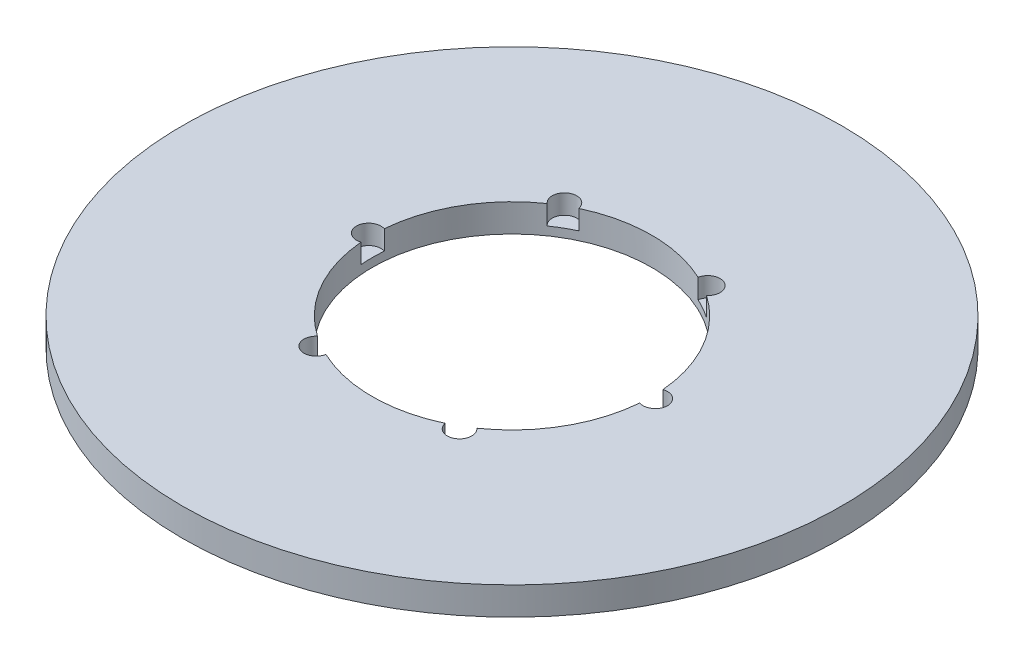
ISO-10303-21;
HEADER;
FILE_DESCRIPTION(('STEP AP214'),'2;1');
FILE_NAME('part.step','',(''),(''),'','','');
FILE_SCHEMA(('AUTOMOTIVE_DESIGN { 1 0 10303 214 1 1 1 1 }'));
ENDSEC;
DATA;
#1=APPLICATION_CONTEXT('core data for automotive mechanical design processes');
#2=APPLICATION_PROTOCOL_DEFINITION('international standard','automotive_design',2000,#1);
#3=PRODUCT_CONTEXT('',#1,'mechanical');
#4=PRODUCT('Part','Part','',(#3));
#5=PRODUCT_RELATED_PRODUCT_CATEGORY('part','',(#4));
#6=PRODUCT_DEFINITION_FORMATION('','',#4);
#7=PRODUCT_DEFINITION_CONTEXT('part definition',#1,'design');
#8=PRODUCT_DEFINITION('design','',#6,#7);
#9=PRODUCT_DEFINITION_SHAPE('','',#8);
#10=(LENGTH_UNIT() NAMED_UNIT(*) SI_UNIT(.MILLI.,.METRE.));
#11=(NAMED_UNIT(*) PLANE_ANGLE_UNIT() SI_UNIT($,.RADIAN.));
#12=(NAMED_UNIT(*) SI_UNIT($,.STERADIAN.) SOLID_ANGLE_UNIT());
#13=UNCERTAINTY_MEASURE_WITH_UNIT(LENGTH_MEASURE(1.E-05),#10,'distance_accuracy_value','');
#14=(GEOMETRIC_REPRESENTATION_CONTEXT(3) GLOBAL_UNCERTAINTY_ASSIGNED_CONTEXT((#13)) GLOBAL_UNIT_ASSIGNED_CONTEXT((#10,
#11,#12)) REPRESENTATION_CONTEXT('',''));
#15=CARTESIAN_POINT('',(0.,0.,0.));
#16=DIRECTION('',(0.,0.,1.));
#17=DIRECTION('',(1.,0.,0.));
#18=AXIS2_PLACEMENT_3D('',#15,#16,#17);
#19=CARTESIAN_POINT('',(0.,7.,0.));
#20=DIRECTION('',(0.,-1.,0.));
#21=DIRECTION('',(0.,0.,-1.));
#22=AXIS2_PLACEMENT_3D('',#19,#20,#21);
#23=CYLINDRICAL_SURFACE('',#22,82.5);
#24=CARTESIAN_POINT('',(0.,7.,0.));
#25=DIRECTION('',(0.,1.,0.));
#26=DIRECTION('',(0.,0.,1.));
#27=AXIS2_PLACEMENT_3D('',#24,#25,#26);
#28=CIRCLE('',#27,82.5);
#29=CARTESIAN_POINT('',(0.,7.,82.5));
#30=VERTEX_POINT('',#29);
#31=EDGE_CURVE('E171',#30,#30,#28,.T.);
#32=ORIENTED_EDGE('',*,*,#31,.F.);
#33=EDGE_LOOP('',(#32));
#34=FACE_BOUND('',#33,.T.);
#35=CARTESIAN_POINT('',(0.,0.,0.));
#36=DIRECTION('',(0.,1.,0.));
#37=DIRECTION('',(0.,0.,1.));
#38=AXIS2_PLACEMENT_3D('',#35,#36,#37);
#39=CIRCLE('',#38,82.5);
#40=CARTESIAN_POINT('',(0.,0.,82.5));
#41=VERTEX_POINT('',#40);
#42=EDGE_CURVE('E157',#41,#41,#39,.T.);
#43=ORIENTED_EDGE('',*,*,#42,.T.);
#44=EDGE_LOOP('',(#43));
#45=FACE_BOUND('',#44,.T.);
#46=ADVANCED_FACE('F39',(#34,#45),#23,.T.);
#47=CARTESIAN_POINT('',(0.,7.,0.));
#48=DIRECTION('',(0.,1.,0.));
#49=DIRECTION('',(0.,0.,1.));
#50=AXIS2_PLACEMENT_3D('',#47,#48,#49);
#51=PLANE('',#50);
#52=CARTESIAN_POINT('',(-17.9392674309865,7.,-31.0717226410333));
#53=DIRECTION('',(0.,1.,0.));
#54=DIRECTION('',(-0.866025403784433,0.,0.50000000000001));
#55=AXIS2_PLACEMENT_3D('',#52,#53,#54);
#56=CIRCLE('',#55,3.06695853790729);
#57=CARTESIAN_POINT('',(-14.9285850933766,7.,-31.6565529884385));
#58=VERTEX_POINT('',#57);
#59=CARTESIAN_POINT('',(-19.9510865375483,7.,-28.7568104276406));
#60=VERTEX_POINT('',#59);
#61=EDGE_CURVE('E214',#58,#60,#56,.T.);
#62=ORIENTED_EDGE('',*,*,#61,.F.);
#63=CARTESIAN_POINT('',(0.,7.,0.));
#64=DIRECTION('',(0.,1.,0.));
#65=DIRECTION('',(0.,0.,1.));
#66=AXIS2_PLACEMENT_3D('',#63,#64,#65);
#67=CIRCLE('',#66,35.);
#68=CARTESIAN_POINT('',(14.9285850933759,7.,-31.6565529884388));
#69=VERTEX_POINT('',#68);
#70=EDGE_CURVE('E272',#69,#58,#67,.T.);
#71=ORIENTED_EDGE('',*,*,#70,.F.);
#72=CARTESIAN_POINT('',(17.9392674309858,7.,-31.0717226410337));
#73=DIRECTION('',(0.,1.,0.));
#74=DIRECTION('',(-0.866025403784443,0.,-0.499999999999992));
#75=AXIS2_PLACEMENT_3D('',#72,#73,#74);
#76=CIRCLE('',#75,3.06695853790729);
#77=CARTESIAN_POINT('',(19.9510865375477,7.,-28.756810427641));
#78=VERTEX_POINT('',#77);
#79=EDGE_CURVE('E285',#78,#69,#76,.T.);
#80=ORIENTED_EDGE('',*,*,#79,.F.);
#81=CARTESIAN_POINT('',(34.8796716309242,7.,-2.89974256079789));
#82=VERTEX_POINT('',#81);
#83=EDGE_CURVE('E165',#82,#78,#67,.T.);
#84=ORIENTED_EDGE('',*,*,#83,.F.);
#85=CARTESIAN_POINT('',(35.8785348619722,7.,0.));
#86=DIRECTION('',(0.,1.,0.));
#87=DIRECTION('',(0.,0.,-1.));
#88=AXIS2_PLACEMENT_3D('',#85,#86,#87);
#89=CIRCLE('',#88,3.06695853790729);
#90=CARTESIAN_POINT('',(34.8796716309242,7.,2.89974256079789));
#91=VERTEX_POINT('',#90);
#92=EDGE_CURVE('E281',#91,#82,#89,.T.);
#93=ORIENTED_EDGE('',*,*,#92,.F.);
#94=CARTESIAN_POINT('',(19.9510865375481,7.,28.7568104276407));
#95=VERTEX_POINT('',#94);
#96=EDGE_CURVE('E160',#95,#91,#67,.T.);
#97=ORIENTED_EDGE('',*,*,#96,.F.);
#98=CARTESIAN_POINT('',(17.9392674309863,7.,31.0717226410335));
#99=DIRECTION('',(0.,1.,0.));
#100=DIRECTION('',(0.866025403784436,0.,-0.500000000000004));
#101=AXIS2_PLACEMENT_3D('',#98,#99,#100);
#102=CIRCLE('',#101,3.06695853790729);
#103=CARTESIAN_POINT('',(14.9285850933763,7.,31.6565529884386));
#104=VERTEX_POINT('',#103);
#105=EDGE_CURVE('E154',#104,#95,#102,.T.);
#106=ORIENTED_EDGE('',*,*,#105,.F.);
#107=CARTESIAN_POINT('',(-14.9285850933761,7.,31.6565529884387));
#108=VERTEX_POINT('',#107);
#109=EDGE_CURVE('E150',#108,#104,#67,.T.);
#110=ORIENTED_EDGE('',*,*,#109,.F.);
#111=CARTESIAN_POINT('',(-17.939267430986,7.,31.0717226410336));
#112=DIRECTION('',(0.,1.,0.));
#113=DIRECTION('',(0.86602540378444,0.,0.499999999999998));
#114=AXIS2_PLACEMENT_3D('',#111,#112,#113);
#115=CIRCLE('',#114,3.06695853790729);
#116=CARTESIAN_POINT('',(-19.9510865375479,7.,28.7568104276409));
#117=VERTEX_POINT('',#116);
#118=EDGE_CURVE('E127',#117,#108,#115,.T.);
#119=ORIENTED_EDGE('',*,*,#118,.F.);
#120=CARTESIAN_POINT('',(-34.8796716309242,7.,2.89974256079789));
#121=VERTEX_POINT('',#120);
#122=EDGE_CURVE('E156',#121,#117,#67,.T.);
#123=ORIENTED_EDGE('',*,*,#122,.F.);
#124=CARTESIAN_POINT('',(-35.8785348619722,7.,0.));
#125=DIRECTION('',(0.,1.,0.));
#126=DIRECTION('',(0.,0.,1.));
#127=AXIS2_PLACEMENT_3D('',#124,#125,#126);
#128=CIRCLE('',#127,3.06695853790729);
#129=CARTESIAN_POINT('',(-34.8796716309242,7.,-2.89974256079789));
#130=VERTEX_POINT('',#129);
#131=EDGE_CURVE('E164',#130,#121,#128,.T.);
#132=ORIENTED_EDGE('',*,*,#131,.F.);
#133=EDGE_CURVE('E159',#60,#130,#67,.T.);
#134=ORIENTED_EDGE('',*,*,#133,.F.);
#135=EDGE_LOOP('',(#62,#71,#80,#84,#93,#97,#106,#110,#119,#123,#132,#134));
#136=FACE_BOUND('',#135,.T.);
#137=ORIENTED_EDGE('',*,*,#31,.T.);
#138=EDGE_LOOP('',(#137));
#139=FACE_BOUND('',#138,.T.);
#140=ADVANCED_FACE('F155',(#136,#139),#51,.T.);
#141=CARTESIAN_POINT('',(0.,0.,0.));
#142=DIRECTION('',(0.,1.,0.));
#143=DIRECTION('',(0.,0.,1.));
#144=AXIS2_PLACEMENT_3D('',#141,#142,#143);
#145=PLANE('',#144);
#146=CARTESIAN_POINT('',(0.,0.,0.));
#147=DIRECTION('',(0.,1.,0.));
#148=DIRECTION('',(0.,0.,1.));
#149=AXIS2_PLACEMENT_3D('',#146,#147,#148);
#150=CIRCLE('',#149,35.);
#151=CARTESIAN_POINT('',(0.,0.,35.));
#152=VERTEX_POINT('',#151);
#153=EDGE_CURVE('E170',#152,#152,#150,.T.);
#154=ORIENTED_EDGE('',*,*,#153,.T.);
#155=EDGE_LOOP('',(#154));
#156=FACE_BOUND('',#155,.T.);
#157=ORIENTED_EDGE('',*,*,#42,.F.);
#158=EDGE_LOOP('',(#157));
#159=FACE_BOUND('',#158,.T.);
#160=ADVANCED_FACE('F232',(#156,#159),#145,.F.);
#161=CARTESIAN_POINT('',(0.,7.,0.));
#162=DIRECTION('',(0.,-1.,0.));
#163=DIRECTION('',(0.,0.,-1.));
#164=AXIS2_PLACEMENT_3D('',#161,#162,#163);
#165=CYLINDRICAL_SURFACE('',#164,35.);
#166=DIRECTION('',(0.,1.,0.));
#167=VECTOR('',#166,1.);
#168=CARTESIAN_POINT('',(-14.9285850933765,4.56741736566678,-31.6565529884385));
#169=LINE('',#168,#167);
#170=CARTESIAN_POINT('',(-14.9285850933766,2.13483473133356,-31.6565529884385));
#171=VERTEX_POINT('',#170);
#172=EDGE_CURVE('E11',#171,#58,#169,.T.);
#173=ORIENTED_EDGE('',*,*,#172,.F.);
#174=CARTESIAN_POINT('',(0.,2.13483473133356,0.));
#175=DIRECTION('',(0.,1.,0.));
#176=DIRECTION('',(0.,0.,1.));
#177=AXIS2_PLACEMENT_3D('',#174,#175,#176);
#178=CIRCLE('',#177,35.);
#179=CARTESIAN_POINT('',(-19.9510865375483,2.13483473133356,-28.7568104276406));
#180=VERTEX_POINT('',#179);
#181=EDGE_CURVE('E209',#171,#180,#178,.T.);
#182=ORIENTED_EDGE('',*,*,#181,.T.);
#183=DIRECTION('',(0.,1.,0.));
#184=VECTOR('',#183,1.);
#185=CARTESIAN_POINT('',(-19.9510865375483,4.56741736566678,-28.7568104276406));
#186=LINE('',#185,#184);
#187=EDGE_CURVE('E46',#60,#180,#186,.F.);
#188=ORIENTED_EDGE('',*,*,#187,.F.);
#189=ORIENTED_EDGE('',*,*,#133,.T.);
#190=DIRECTION('',(0.,1.,0.));
#191=VECTOR('',#190,1.);
#192=CARTESIAN_POINT('',(-34.8796716309242,4.56741736566678,-2.89974256079788));
#193=LINE('',#192,#191);
#194=CARTESIAN_POINT('',(-34.8796716309242,2.13483473133356,-2.89974256079789));
#195=VERTEX_POINT('',#194);
#196=EDGE_CURVE('E185',#195,#130,#193,.T.);
#197=ORIENTED_EDGE('',*,*,#196,.F.);
#198=CARTESIAN_POINT('',(0.,2.13483473133356,0.));
#199=DIRECTION('',(0.,1.,0.));
#200=DIRECTION('',(0.,0.,1.));
#201=AXIS2_PLACEMENT_3D('',#198,#199,#200);
#202=CIRCLE('',#201,35.);
#203=CARTESIAN_POINT('',(-34.8796716309242,2.13483473133356,2.89974256079789));
#204=VERTEX_POINT('',#203);
#205=EDGE_CURVE('E173',#195,#204,#202,.T.);
#206=ORIENTED_EDGE('',*,*,#205,.T.);
#207=DIRECTION('',(0.,1.,0.));
#208=VECTOR('',#207,1.);
#209=CARTESIAN_POINT('',(-34.8796716309242,4.56741736566678,2.89974256079788));
#210=LINE('',#209,#208);
#211=EDGE_CURVE('E178',#121,#204,#210,.F.);
#212=ORIENTED_EDGE('',*,*,#211,.F.);
#213=ORIENTED_EDGE('',*,*,#122,.T.);
#214=DIRECTION('',(0.,1.,0.));
#215=VECTOR('',#214,1.);
#216=CARTESIAN_POINT('',(-19.9510865375479,4.56741736566678,28.7568104276408));
#217=LINE('',#216,#215);
#218=CARTESIAN_POINT('',(-19.9510865375479,2.13483473133356,28.7568104276409));
#219=VERTEX_POINT('',#218);
#220=EDGE_CURVE('E132',#219,#117,#217,.T.);
#221=ORIENTED_EDGE('',*,*,#220,.F.);
#222=CARTESIAN_POINT('',(0.,2.13483473133356,0.));
#223=DIRECTION('',(0.,1.,0.));
#224=DIRECTION('',(0.,0.,1.));
#225=AXIS2_PLACEMENT_3D('',#222,#223,#224);
#226=CIRCLE('',#225,35.);
#227=CARTESIAN_POINT('',(-14.9285850933761,2.13483473133356,31.6565529884387));
#228=VERTEX_POINT('',#227);
#229=EDGE_CURVE('E146',#219,#228,#226,.T.);
#230=ORIENTED_EDGE('',*,*,#229,.T.);
#231=DIRECTION('',(0.,1.,0.));
#232=VECTOR('',#231,1.);
#233=CARTESIAN_POINT('',(-14.9285850933761,4.56741736566678,31.6565529884387));
#234=LINE('',#233,#232);
#235=EDGE_CURVE('E128',#108,#228,#234,.F.);
#236=ORIENTED_EDGE('',*,*,#235,.F.);
#237=ORIENTED_EDGE('',*,*,#109,.T.);
#238=DIRECTION('',(0.,1.,0.));
#239=VECTOR('',#238,1.);
#240=CARTESIAN_POINT('',(14.9285850933763,4.56741736566678,31.6565529884386));
#241=LINE('',#240,#239);
#242=CARTESIAN_POINT('',(14.9285850933763,2.13483473133356,31.6565529884386));
#243=VERTEX_POINT('',#242);
#244=EDGE_CURVE('E192',#243,#104,#241,.T.);
#245=ORIENTED_EDGE('',*,*,#244,.F.);
#246=CARTESIAN_POINT('',(0.,2.13483473133356,0.));
#247=DIRECTION('',(0.,1.,0.));
#248=DIRECTION('',(0.,0.,1.));
#249=AXIS2_PLACEMENT_3D('',#246,#247,#248);
#250=CIRCLE('',#249,35.);
#251=CARTESIAN_POINT('',(19.9510865375481,2.13483473133356,28.7568104276407));
#252=VERTEX_POINT('',#251);
#253=EDGE_CURVE('E190',#243,#252,#250,.T.);
#254=ORIENTED_EDGE('',*,*,#253,.T.);
#255=DIRECTION('',(0.,1.,0.));
#256=VECTOR('',#255,1.);
#257=CARTESIAN_POINT('',(19.9510865375481,4.56741736566678,28.7568104276407));
#258=LINE('',#257,#256);
#259=EDGE_CURVE('E189',#95,#252,#258,.F.);
#260=ORIENTED_EDGE('',*,*,#259,.F.);
#261=ORIENTED_EDGE('',*,*,#96,.T.);
#262=DIRECTION('',(0.,1.,0.));
#263=VECTOR('',#262,1.);
#264=CARTESIAN_POINT('',(34.8796716309242,4.56741736566678,2.89974256079788));
#265=LINE('',#264,#263);
#266=CARTESIAN_POINT('',(34.8796716309242,2.13483473133356,2.89974256079789));
#267=VERTEX_POINT('',#266);
#268=EDGE_CURVE('E203',#267,#91,#265,.T.);
#269=ORIENTED_EDGE('',*,*,#268,.F.);
#270=CARTESIAN_POINT('',(0.,2.13483473133356,0.));
#271=DIRECTION('',(0.,1.,0.));
#272=DIRECTION('',(0.,0.,1.));
#273=AXIS2_PLACEMENT_3D('',#270,#271,#272);
#274=CIRCLE('',#273,35.);
#275=CARTESIAN_POINT('',(34.8796716309242,2.13483473133356,-2.89974256079789));
#276=VERTEX_POINT('',#275);
#277=EDGE_CURVE('E194',#267,#276,#274,.T.);
#278=ORIENTED_EDGE('',*,*,#277,.T.);
#279=DIRECTION('',(0.,1.,0.));
#280=VECTOR('',#279,1.);
#281=CARTESIAN_POINT('',(34.8796716309242,4.56741736566678,-2.89974256079788));
#282=LINE('',#281,#280);
#283=EDGE_CURVE('E196',#82,#276,#282,.F.);
#284=ORIENTED_EDGE('',*,*,#283,.F.);
#285=ORIENTED_EDGE('',*,*,#83,.T.);
#286=DIRECTION('',(0.,1.,0.));
#287=VECTOR('',#286,1.);
#288=CARTESIAN_POINT('',(19.9510865375477,4.56741736566678,-28.756810427641));
#289=LINE('',#288,#287);
#290=CARTESIAN_POINT('',(19.9510865375477,2.13483473133356,-28.756810427641));
#291=VERTEX_POINT('',#290);
#292=EDGE_CURVE('E208',#291,#78,#289,.T.);
#293=ORIENTED_EDGE('',*,*,#292,.F.);
#294=CARTESIAN_POINT('',(0.,2.13483473133356,0.));
#295=DIRECTION('',(0.,1.,0.));
#296=DIRECTION('',(0.,0.,1.));
#297=AXIS2_PLACEMENT_3D('',#294,#295,#296);
#298=CIRCLE('',#297,35.);
#299=CARTESIAN_POINT('',(14.9285850933759,2.13483473133356,-31.6565529884388));
#300=VERTEX_POINT('',#299);
#301=EDGE_CURVE('E201',#291,#300,#298,.T.);
#302=ORIENTED_EDGE('',*,*,#301,.T.);
#303=DIRECTION('',(0.,1.,0.));
#304=VECTOR('',#303,1.);
#305=CARTESIAN_POINT('',(14.9285850933759,4.56741736566678,-31.6565529884388));
#306=LINE('',#305,#304);
#307=EDGE_CURVE('E206',#69,#300,#306,.F.);
#308=ORIENTED_EDGE('',*,*,#307,.F.);
#309=ORIENTED_EDGE('',*,*,#70,.T.);
#310=EDGE_LOOP('',(#173,#182,#188,#189,#197,#206,#212,#213,#221,#230,#236,#237,#245,#254,#260,
#261,#269,#278,#284,#285,#293,#302,#308,#309));
#311=FACE_BOUND('',#310,.T.);
#312=ORIENTED_EDGE('',*,*,#153,.F.);
#313=EDGE_LOOP('',(#312));
#314=FACE_BOUND('',#313,.T.);
#315=ADVANCED_FACE('F145',(#311,#314),#165,.F.);
#316=CARTESIAN_POINT('',(-35.8785348619722,2.13483473133356,0.));
#317=DIRECTION('',(0.,1.,0.));
#318=DIRECTION('',(0.,0.,1.));
#319=AXIS2_PLACEMENT_3D('',#316,#317,#318);
#320=CYLINDRICAL_SURFACE('',#319,3.06695853790729);
#321=ORIENTED_EDGE('',*,*,#196,.T.);
#322=ORIENTED_EDGE('',*,*,#131,.T.);
#323=ORIENTED_EDGE('',*,*,#211,.T.);
#324=CARTESIAN_POINT('',(-35.8785348619722,2.13483473133356,0.));
#325=DIRECTION('',(0.,1.,0.));
#326=DIRECTION('',(0.,0.,1.));
#327=AXIS2_PLACEMENT_3D('',#324,#325,#326);
#328=CIRCLE('',#327,3.06695853790729);
#329=EDGE_CURVE('E168',#195,#204,#328,.T.);
#330=ORIENTED_EDGE('',*,*,#329,.F.);
#331=EDGE_LOOP('',(#321,#322,#323,#330));
#332=FACE_BOUND('',#331,.T.);
#333=ADVANCED_FACE('F243',(#332),#320,.F.);
#334=CARTESIAN_POINT('',(-35.8785348619722,2.13483473133356,0.));
#335=DIRECTION('',(0.,1.,0.));
#336=DIRECTION('',(0.,0.,1.));
#337=AXIS2_PLACEMENT_3D('',#334,#335,#336);
#338=PLANE('',#337);
#339=ORIENTED_EDGE('',*,*,#329,.T.);
#340=ORIENTED_EDGE('',*,*,#205,.F.);
#341=EDGE_LOOP('',(#339,#340));
#342=FACE_BOUND('',#341,.T.);
#343=ADVANCED_FACE('F247',(#342),#338,.T.);
#344=CARTESIAN_POINT('',(-17.939267430986,2.13483473133356,31.0717226410336));
#345=DIRECTION('',(0.,1.,0.));
#346=DIRECTION('',(0.,0.,1.));
#347=AXIS2_PLACEMENT_3D('',#344,#345,#346);
#348=CYLINDRICAL_SURFACE('',#347,3.06695853790729);
#349=ORIENTED_EDGE('',*,*,#220,.T.);
#350=ORIENTED_EDGE('',*,*,#118,.T.);
#351=ORIENTED_EDGE('',*,*,#235,.T.);
#352=CARTESIAN_POINT('',(-17.939267430986,2.13483473133356,31.0717226410336));
#353=DIRECTION('',(0.,1.,0.));
#354=DIRECTION('',(0.86602540378444,0.,0.499999999999998));
#355=AXIS2_PLACEMENT_3D('',#352,#353,#354);
#356=CIRCLE('',#355,3.06695853790729);
#357=EDGE_CURVE('E137',#219,#228,#356,.T.);
#358=ORIENTED_EDGE('',*,*,#357,.F.);
#359=EDGE_LOOP('',(#349,#350,#351,#358));
#360=FACE_BOUND('',#359,.T.);
#361=ADVANCED_FACE('F126',(#360),#348,.F.);
#362=CARTESIAN_POINT('',(-17.939267430986,2.13483473133356,31.0717226410336));
#363=DIRECTION('',(0.,1.,0.));
#364=DIRECTION('',(0.86602540378444,0.,0.499999999999998));
#365=AXIS2_PLACEMENT_3D('',#362,#363,#364);
#366=PLANE('',#365);
#367=ORIENTED_EDGE('',*,*,#357,.T.);
#368=ORIENTED_EDGE('',*,*,#229,.F.);
#369=EDGE_LOOP('',(#367,#368));
#370=FACE_BOUND('',#369,.T.);
#371=ADVANCED_FACE('F254',(#370),#366,.T.);
#372=CARTESIAN_POINT('',(17.9392674309863,2.13483473133356,31.0717226410335));
#373=DIRECTION('',(0.,1.,0.));
#374=DIRECTION('',(0.,0.,1.));
#375=AXIS2_PLACEMENT_3D('',#372,#373,#374);
#376=CYLINDRICAL_SURFACE('',#375,3.06695853790729);
#377=ORIENTED_EDGE('',*,*,#244,.T.);
#378=ORIENTED_EDGE('',*,*,#105,.T.);
#379=ORIENTED_EDGE('',*,*,#259,.T.);
#380=CARTESIAN_POINT('',(17.9392674309863,2.13483473133356,31.0717226410335));
#381=DIRECTION('',(0.,1.,0.));
#382=DIRECTION('',(0.866025403784436,0.,-0.500000000000004));
#383=AXIS2_PLACEMENT_3D('',#380,#381,#382);
#384=CIRCLE('',#383,3.06695853790729);
#385=EDGE_CURVE('E138',#243,#252,#384,.T.);
#386=ORIENTED_EDGE('',*,*,#385,.F.);
#387=EDGE_LOOP('',(#377,#378,#379,#386));
#388=FACE_BOUND('',#387,.T.);
#389=ADVANCED_FACE('F260',(#388),#376,.F.);
#390=CARTESIAN_POINT('',(17.9392674309863,2.13483473133356,31.0717226410335));
#391=DIRECTION('',(0.,1.,0.));
#392=DIRECTION('',(0.866025403784436,0.,-0.500000000000004));
#393=AXIS2_PLACEMENT_3D('',#390,#391,#392);
#394=PLANE('',#393);
#395=ORIENTED_EDGE('',*,*,#385,.T.);
#396=ORIENTED_EDGE('',*,*,#253,.F.);
#397=EDGE_LOOP('',(#395,#396));
#398=FACE_BOUND('',#397,.T.);
#399=ADVANCED_FACE('F265',(#398),#394,.T.);
#400=CARTESIAN_POINT('',(35.8785348619722,2.13483473133356,0.));
#401=DIRECTION('',(0.,1.,0.));
#402=DIRECTION('',(0.,0.,1.));
#403=AXIS2_PLACEMENT_3D('',#400,#401,#402);
#404=CYLINDRICAL_SURFACE('',#403,3.06695853790729);
#405=ORIENTED_EDGE('',*,*,#268,.T.);
#406=ORIENTED_EDGE('',*,*,#92,.T.);
#407=ORIENTED_EDGE('',*,*,#283,.T.);
#408=CARTESIAN_POINT('',(35.8785348619722,2.13483473133356,0.));
#409=DIRECTION('',(0.,1.,0.));
#410=DIRECTION('',(0.,0.,-1.));
#411=AXIS2_PLACEMENT_3D('',#408,#409,#410);
#412=CIRCLE('',#411,3.06695853790729);
#413=EDGE_CURVE('E287',#267,#276,#412,.T.);
#414=ORIENTED_EDGE('',*,*,#413,.F.);
#415=EDGE_LOOP('',(#405,#406,#407,#414));
#416=FACE_BOUND('',#415,.T.);
#417=ADVANCED_FACE('F300',(#416),#404,.F.);
#418=CARTESIAN_POINT('',(35.8785348619722,2.13483473133356,0.));
#419=DIRECTION('',(0.,1.,0.));
#420=DIRECTION('',(0.,0.,-1.));
#421=AXIS2_PLACEMENT_3D('',#418,#419,#420);
#422=PLANE('',#421);
#423=ORIENTED_EDGE('',*,*,#413,.T.);
#424=ORIENTED_EDGE('',*,*,#277,.F.);
#425=EDGE_LOOP('',(#423,#424));
#426=FACE_BOUND('',#425,.T.);
#427=ADVANCED_FACE('F298',(#426),#422,.T.);
#428=CARTESIAN_POINT('',(17.9392674309858,2.13483473133356,-31.0717226410337));
#429=DIRECTION('',(0.,1.,0.));
#430=DIRECTION('',(0.,0.,1.));
#431=AXIS2_PLACEMENT_3D('',#428,#429,#430);
#432=CYLINDRICAL_SURFACE('',#431,3.06695853790729);
#433=ORIENTED_EDGE('',*,*,#292,.T.);
#434=ORIENTED_EDGE('',*,*,#79,.T.);
#435=ORIENTED_EDGE('',*,*,#307,.T.);
#436=CARTESIAN_POINT('',(17.9392674309858,2.13483473133356,-31.0717226410337));
#437=DIRECTION('',(0.,1.,0.));
#438=DIRECTION('',(-0.866025403784443,0.,-0.499999999999992));
#439=AXIS2_PLACEMENT_3D('',#436,#437,#438);
#440=CIRCLE('',#439,3.06695853790729);
#441=EDGE_CURVE('E56',#291,#300,#440,.T.);
#442=ORIENTED_EDGE('',*,*,#441,.F.);
#443=EDGE_LOOP('',(#433,#434,#435,#442));
#444=FACE_BOUND('',#443,.T.);
#445=ADVANCED_FACE('F301',(#444),#432,.F.);
#446=CARTESIAN_POINT('',(17.9392674309858,2.13483473133356,-31.0717226410337));
#447=DIRECTION('',(0.,1.,0.));
#448=DIRECTION('',(-0.866025403784443,0.,-0.499999999999992));
#449=AXIS2_PLACEMENT_3D('',#446,#447,#448);
#450=PLANE('',#449);
#451=ORIENTED_EDGE('',*,*,#441,.T.);
#452=ORIENTED_EDGE('',*,*,#301,.F.);
#453=EDGE_LOOP('',(#451,#452));
#454=FACE_BOUND('',#453,.T.);
#455=ADVANCED_FACE('F221',(#454),#450,.T.);
#456=CARTESIAN_POINT('',(-17.9392674309865,2.13483473133356,-31.0717226410333));
#457=DIRECTION('',(0.,1.,0.));
#458=DIRECTION('',(0.,0.,1.));
#459=AXIS2_PLACEMENT_3D('',#456,#457,#458);
#460=CYLINDRICAL_SURFACE('',#459,3.06695853790729);
#461=ORIENTED_EDGE('',*,*,#172,.T.);
#462=ORIENTED_EDGE('',*,*,#61,.T.);
#463=ORIENTED_EDGE('',*,*,#187,.T.);
#464=CARTESIAN_POINT('',(-17.9392674309865,2.13483473133356,-31.0717226410333));
#465=DIRECTION('',(0.,1.,0.));
#466=DIRECTION('',(-0.866025403784433,0.,0.50000000000001));
#467=AXIS2_PLACEMENT_3D('',#464,#465,#466);
#468=CIRCLE('',#467,3.06695853790729);
#469=EDGE_CURVE('E55',#171,#180,#468,.T.);
#470=ORIENTED_EDGE('',*,*,#469,.F.);
#471=EDGE_LOOP('',(#461,#462,#463,#470));
#472=FACE_BOUND('',#471,.T.);
#473=ADVANCED_FACE('F212',(#472),#460,.F.);
#474=CARTESIAN_POINT('',(-17.9392674309865,2.13483473133356,-31.0717226410333));
#475=DIRECTION('',(0.,1.,0.));
#476=DIRECTION('',(-0.866025403784433,0.,0.50000000000001));
#477=AXIS2_PLACEMENT_3D('',#474,#475,#476);
#478=PLANE('',#477);
#479=ORIENTED_EDGE('',*,*,#469,.T.);
#480=ORIENTED_EDGE('',*,*,#181,.F.);
#481=EDGE_LOOP('',(#479,#480));
#482=FACE_BOUND('',#481,.T.);
#483=ADVANCED_FACE('F217',(#482),#478,.T.);
#484=CLOSED_SHELL('',(#46,#140,#160,#315,#333,#343,#361,#371,#389,#399,#417,#427,#445,#455,#473,#483));
#485=MANIFOLD_SOLID_BREP('B2',#484);
#486=ADVANCED_BREP_SHAPE_REPRESENTATION('',(#18,#485),#14);
#487=SHAPE_DEFINITION_REPRESENTATION(#9,#486);
ENDSEC;
END-ISO-10303-21;
